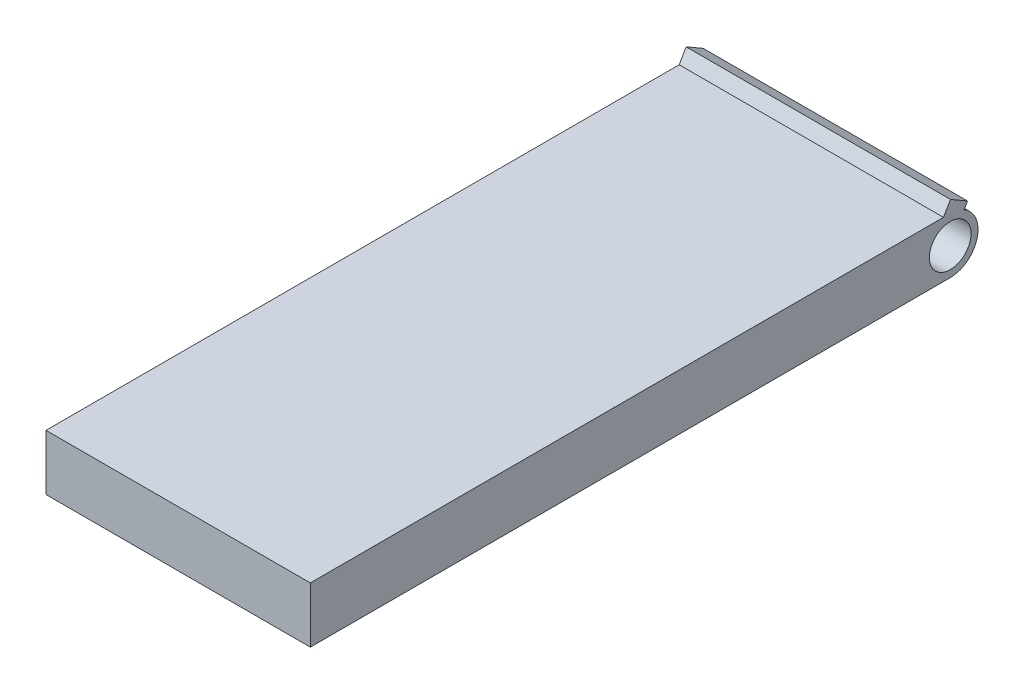
ISO-10303-21;
HEADER;
FILE_DESCRIPTION(('STEP AP214'),'2;1');
FILE_NAME('part.step','',(''),(''),'','','');
FILE_SCHEMA(('AUTOMOTIVE_DESIGN { 1 0 10303 214 1 1 1 1 }'));
ENDSEC;
DATA;
#1=APPLICATION_CONTEXT('core data for automotive mechanical design processes');
#2=APPLICATION_PROTOCOL_DEFINITION('international standard','automotive_design',2000,#1);
#3=PRODUCT_CONTEXT('',#1,'mechanical');
#4=PRODUCT('Part','Part','',(#3));
#5=PRODUCT_RELATED_PRODUCT_CATEGORY('part','',(#4));
#6=PRODUCT_DEFINITION_FORMATION('','',#4);
#7=PRODUCT_DEFINITION_CONTEXT('part definition',#1,'design');
#8=PRODUCT_DEFINITION('design','',#6,#7);
#9=PRODUCT_DEFINITION_SHAPE('','',#8);
#10=(LENGTH_UNIT() NAMED_UNIT(*) SI_UNIT(.MILLI.,.METRE.));
#11=(NAMED_UNIT(*) PLANE_ANGLE_UNIT() SI_UNIT($,.RADIAN.));
#12=(NAMED_UNIT(*) SI_UNIT($,.STERADIAN.) SOLID_ANGLE_UNIT());
#13=UNCERTAINTY_MEASURE_WITH_UNIT(LENGTH_MEASURE(1.E-05),#10,'distance_accuracy_value','');
#14=(GEOMETRIC_REPRESENTATION_CONTEXT(3) GLOBAL_UNCERTAINTY_ASSIGNED_CONTEXT((#13)) GLOBAL_UNIT_ASSIGNED_CONTEXT((#10,
#11,#12)) REPRESENTATION_CONTEXT('',''));
#15=CARTESIAN_POINT('',(0.,0.,0.));
#16=DIRECTION('',(0.,0.,1.));
#17=DIRECTION('',(1.,0.,0.));
#18=AXIS2_PLACEMENT_3D('',#15,#16,#17);
#19=CARTESIAN_POINT('',(0.,2.,0.));
#20=DIRECTION('',(0.,-1.,0.));
#21=DIRECTION('',(0.,0.,-1.));
#22=AXIS2_PLACEMENT_3D('',#19,#20,#21);
#23=PLANE('',#22);
#24=DIRECTION('',(1.,0.,0.));
#25=VECTOR('',#24,1.);
#26=CARTESIAN_POINT('',(-5.71697859541147,2.,-11.0197316533766));
#27=LINE('',#26,#25);
#28=CARTESIAN_POINT('',(-4.75,2.,-11.0197316533766));
#29=VERTEX_POINT('',#28);
#30=CARTESIAN_POINT('',(4.75,2.,-11.0197316533766));
#31=VERTEX_POINT('',#30);
#32=EDGE_CURVE('E98',#29,#31,#27,.T.);
#33=ORIENTED_EDGE('',*,*,#32,.F.);
#34=DIRECTION('',(0.,0.,1.));
#35=VECTOR('',#34,1.);
#36=CARTESIAN_POINT('',(-4.75,2.,-12.261859188115));
#37=LINE('',#36,#35);
#38=CARTESIAN_POINT('',(-4.75,2.,11.738140811885));
#39=VERTEX_POINT('',#38);
#40=EDGE_CURVE('E189',#29,#39,#37,.T.);
#41=ORIENTED_EDGE('',*,*,#40,.T.);
#42=DIRECTION('',(1.,0.,0.));
#43=VECTOR('',#42,1.);
#44=CARTESIAN_POINT('',(4.75,2.,11.738140811885));
#45=LINE('',#44,#43);
#46=CARTESIAN_POINT('',(4.75,2.,11.738140811885));
#47=VERTEX_POINT('',#46);
#48=EDGE_CURVE('E191',#39,#47,#45,.T.);
#49=ORIENTED_EDGE('',*,*,#48,.T.);
#50=DIRECTION('',(0.,0.,-1.));
#51=VECTOR('',#50,1.);
#52=CARTESIAN_POINT('',(4.75,2.,-12.261859188115));
#53=LINE('',#52,#51);
#54=EDGE_CURVE('E194',#47,#31,#53,.T.);
#55=ORIENTED_EDGE('',*,*,#54,.T.);
#56=EDGE_LOOP('',(#33,#41,#49,#55));
#57=FACE_BOUND('',#56,.T.);
#58=ADVANCED_FACE('F83',(#57),#23,.F.);
#59=CARTESIAN_POINT('',(-4.75,2.,-12.261859188115));
#60=DIRECTION('',(1.,0.,0.));
#61=DIRECTION('',(0.,0.,-1.));
#62=AXIS2_PLACEMENT_3D('',#59,#60,#61);
#63=PLANE('',#62);
#64=CARTESIAN_POINT('',(-4.75,1.,-11.261859188115));
#65=DIRECTION('',(1.,0.,0.));
#66=DIRECTION('',(0.,0.,-1.));
#67=AXIS2_PLACEMENT_3D('',#64,#65,#66);
#68=CIRCLE('',#67,0.75);
#69=CARTESIAN_POINT('',(-4.75,1.,-12.011859188115));
#70=VERTEX_POINT('',#69);
#71=EDGE_CURVE('E183',#70,#70,#68,.T.);
#72=ORIENTED_EDGE('',*,*,#71,.T.);
#73=EDGE_LOOP('',(#72));
#74=FACE_BOUND('',#73,.T.);
#75=DIRECTION('',(0.,0.866025403784436,-0.500000000000004));
#76=VECTOR('',#75,1.);
#77=CARTESIAN_POINT('',(-4.75,-4.6265280753754,-8.01338168919396));
#78=LINE('',#77,#76);
#79=CARTESIAN_POINT('',(-4.75,1.86602540378444,-11.761859188115));
#80=VERTEX_POINT('',#79);
#81=CARTESIAN_POINT('',(-4.75,2.07816840387267,-11.8843400063226));
#82=VERTEX_POINT('',#81);
#83=EDGE_CURVE('E172',#80,#82,#78,.T.);
#84=ORIENTED_EDGE('',*,*,#83,.F.);
#85=CARTESIAN_POINT('',(-4.75,1.,-11.261859188115));
#86=DIRECTION('',(1.,0.,0.));
#87=DIRECTION('',(0.,0.,-1.));
#88=AXIS2_PLACEMENT_3D('',#85,#86,#87);
#89=CIRCLE('',#88,1.);
#90=CARTESIAN_POINT('',(-4.75,0.,-11.261859188115));
#91=VERTEX_POINT('',#90);
#92=EDGE_CURVE('E177',#91,#80,#89,.T.);
#93=ORIENTED_EDGE('',*,*,#92,.F.);
#94=DIRECTION('',(0.,0.,1.));
#95=VECTOR('',#94,1.);
#96=CARTESIAN_POINT('',(-4.75,0.,-12.261859188115));
#97=LINE('',#96,#95);
#98=CARTESIAN_POINT('',(-4.75,0.,11.738140811885));
#99=VERTEX_POINT('',#98);
#100=EDGE_CURVE('E186',#91,#99,#97,.T.);
#101=ORIENTED_EDGE('',*,*,#100,.T.);
#102=DIRECTION('',(0.,-1.,0.));
#103=VECTOR('',#102,1.);
#104=CARTESIAN_POINT('',(-4.75,2.,11.738140811885));
#105=LINE('',#104,#103);
#106=EDGE_CURVE('E12',#39,#99,#105,.T.);
#107=ORIENTED_EDGE('',*,*,#106,.F.);
#108=ORIENTED_EDGE('',*,*,#40,.F.);
#109=DIRECTION('',(0.,0.866025403784437,-0.500000000000004));
#110=VECTOR('',#109,1.);
#111=CARTESIAN_POINT('',(-4.75,-4.27168377735585,-7.398773336248));
#112=LINE('',#111,#110);
#113=CARTESIAN_POINT('',(-4.75,2.43301270189222,-11.2697316533766));
#114=VERTEX_POINT('',#113);
#115=EDGE_CURVE('E170',#29,#114,#112,.T.);
#116=ORIENTED_EDGE('',*,*,#115,.T.);
#117=DIRECTION('',(0.,-0.500000000000004,-0.866025403784437));
#118=VECTOR('',#117,1.);
#119=CARTESIAN_POINT('',(-4.75,6.70469647924807,-3.87095831712865));
#120=LINE('',#119,#118);
#121=EDGE_CURVE('E150',#114,#82,#120,.T.);
#122=ORIENTED_EDGE('',*,*,#121,.T.);
#123=EDGE_LOOP('',(#84,#93,#101,#107,#108,#116,#122));
#124=FACE_BOUND('',#123,.T.);
#125=ADVANCED_FACE('F85',(#74,#124),#63,.F.);
#126=CARTESIAN_POINT('',(4.75,2.,-12.261859188115));
#127=DIRECTION('',(-1.,0.,0.));
#128=DIRECTION('',(0.,0.,1.));
#129=AXIS2_PLACEMENT_3D('',#126,#127,#128);
#130=PLANE('',#129);
#131=CARTESIAN_POINT('',(4.75,1.,-11.261859188115));
#132=DIRECTION('',(1.,0.,0.));
#133=DIRECTION('',(0.,0.,-1.));
#134=AXIS2_PLACEMENT_3D('',#131,#132,#133);
#135=CIRCLE('',#134,0.75);
#136=CARTESIAN_POINT('',(4.75,1.,-12.011859188115));
#137=VERTEX_POINT('',#136);
#138=EDGE_CURVE('E182',#137,#137,#135,.T.);
#139=ORIENTED_EDGE('',*,*,#138,.F.);
#140=EDGE_LOOP('',(#139));
#141=FACE_BOUND('',#140,.T.);
#142=CARTESIAN_POINT('',(4.75,1.,-11.261859188115));
#143=DIRECTION('',(1.,0.,0.));
#144=DIRECTION('',(0.,0.,-1.));
#145=AXIS2_PLACEMENT_3D('',#142,#143,#144);
#146=CIRCLE('',#145,1.);
#147=CARTESIAN_POINT('',(4.75,0.,-11.261859188115));
#148=VERTEX_POINT('',#147);
#149=CARTESIAN_POINT('',(4.75,1.86602540378444,-11.761859188115));
#150=VERTEX_POINT('',#149);
#151=EDGE_CURVE('E106',#148,#150,#146,.T.);
#152=ORIENTED_EDGE('',*,*,#151,.T.);
#153=DIRECTION('',(0.,0.866025403784436,-0.500000000000004));
#154=VECTOR('',#153,1.);
#155=CARTESIAN_POINT('',(4.75,-4.6265280753754,-8.01338168919396));
#156=LINE('',#155,#154);
#157=CARTESIAN_POINT('',(4.75,2.07816840387267,-11.8843400063226));
#158=VERTEX_POINT('',#157);
#159=EDGE_CURVE('E162',#150,#158,#156,.T.);
#160=ORIENTED_EDGE('',*,*,#159,.T.);
#161=DIRECTION('',(0.,0.500000000000004,0.866025403784437));
#162=VECTOR('',#161,1.);
#163=CARTESIAN_POINT('',(4.75,6.70469647924807,-3.87095831712865));
#164=LINE('',#163,#162);
#165=CARTESIAN_POINT('',(4.75,2.43301270189222,-11.2697316533766));
#166=VERTEX_POINT('',#165);
#167=EDGE_CURVE('E148',#158,#166,#164,.T.);
#168=ORIENTED_EDGE('',*,*,#167,.T.);
#169=DIRECTION('',(0.,-0.866025403784437,0.500000000000004));
#170=VECTOR('',#169,1.);
#171=CARTESIAN_POINT('',(4.75,-4.27168377735585,-7.398773336248));
#172=LINE('',#171,#170);
#173=EDGE_CURVE('E153',#166,#31,#172,.T.);
#174=ORIENTED_EDGE('',*,*,#173,.T.);
#175=ORIENTED_EDGE('',*,*,#54,.F.);
#176=DIRECTION('',(0.,-1.,0.));
#177=VECTOR('',#176,1.);
#178=CARTESIAN_POINT('',(4.75,2.,11.738140811885));
#179=LINE('',#178,#177);
#180=CARTESIAN_POINT('',(4.75,0.,11.738140811885));
#181=VERTEX_POINT('',#180);
#182=EDGE_CURVE('E91',#47,#181,#179,.T.);
#183=ORIENTED_EDGE('',*,*,#182,.T.);
#184=DIRECTION('',(0.,0.,-1.));
#185=VECTOR('',#184,1.);
#186=CARTESIAN_POINT('',(4.75,0.,-12.261859188115));
#187=LINE('',#186,#185);
#188=EDGE_CURVE('E192',#181,#148,#187,.T.);
#189=ORIENTED_EDGE('',*,*,#188,.T.);
#190=EDGE_LOOP('',(#152,#160,#168,#174,#175,#183,#189));
#191=FACE_BOUND('',#190,.T.);
#192=ADVANCED_FACE('F160',(#141,#191),#130,.F.);
#193=CARTESIAN_POINT('',(0.,0.,0.));
#194=DIRECTION('',(0.,-1.,0.));
#195=DIRECTION('',(0.,0.,-1.));
#196=AXIS2_PLACEMENT_3D('',#193,#194,#195);
#197=PLANE('',#196);
#198=ORIENTED_EDGE('',*,*,#100,.F.);
#199=DIRECTION('',(1.,0.,0.));
#200=VECTOR('',#199,1.);
#201=CARTESIAN_POINT('',(-4.75,0.,-11.261859188115));
#202=LINE('',#201,#200);
#203=EDGE_CURVE('E179',#91,#148,#202,.T.);
#204=ORIENTED_EDGE('',*,*,#203,.T.);
#205=ORIENTED_EDGE('',*,*,#188,.F.);
#206=DIRECTION('',(1.,0.,0.));
#207=VECTOR('',#206,1.);
#208=CARTESIAN_POINT('',(4.75,0.,11.738140811885));
#209=LINE('',#208,#207);
#210=EDGE_CURVE('E197',#99,#181,#209,.T.);
#211=ORIENTED_EDGE('',*,*,#210,.F.);
#212=EDGE_LOOP('',(#198,#204,#205,#211));
#213=FACE_BOUND('',#212,.T.);
#214=ADVANCED_FACE('F208',(#213),#197,.T.);
#215=CARTESIAN_POINT('',(4.75,2.,11.738140811885));
#216=DIRECTION('',(0.,0.,-1.));
#217=DIRECTION('',(-1.,0.,0.));
#218=AXIS2_PLACEMENT_3D('',#215,#216,#217);
#219=PLANE('',#218);
#220=ORIENTED_EDGE('',*,*,#210,.T.);
#221=ORIENTED_EDGE('',*,*,#182,.F.);
#222=ORIENTED_EDGE('',*,*,#48,.F.);
#223=ORIENTED_EDGE('',*,*,#106,.T.);
#224=EDGE_LOOP('',(#220,#221,#222,#223));
#225=FACE_BOUND('',#224,.T.);
#226=ADVANCED_FACE('F236',(#225),#219,.F.);
#227=CARTESIAN_POINT('',(-4.75,1.,-11.261859188115));
#228=DIRECTION('',(1.,0.,0.));
#229=DIRECTION('',(0.,0.,-1.));
#230=AXIS2_PLACEMENT_3D('',#227,#228,#229);
#231=CYLINDRICAL_SURFACE('',#230,0.75);
#232=ORIENTED_EDGE('',*,*,#71,.F.);
#233=EDGE_LOOP('',(#232));
#234=FACE_BOUND('',#233,.T.);
#235=ORIENTED_EDGE('',*,*,#138,.T.);
#236=EDGE_LOOP('',(#235));
#237=FACE_BOUND('',#236,.T.);
#238=ADVANCED_FACE('F224',(#234,#237),#231,.F.);
#239=CARTESIAN_POINT('',(-4.75,1.,-11.261859188115));
#240=DIRECTION('',(1.,0.,0.));
#241=DIRECTION('',(0.,0.,-1.));
#242=AXIS2_PLACEMENT_3D('',#239,#240,#241);
#243=CYLINDRICAL_SURFACE('',#242,1.);
#244=ORIENTED_EDGE('',*,*,#151,.F.);
#245=ORIENTED_EDGE('',*,*,#203,.F.);
#246=ORIENTED_EDGE('',*,*,#92,.T.);
#247=DIRECTION('',(1.,0.,0.));
#248=VECTOR('',#247,1.);
#249=CARTESIAN_POINT('',(-4.75,1.86602540378444,-11.761859188115));
#250=LINE('',#249,#248);
#251=EDGE_CURVE('E174',#80,#150,#250,.T.);
#252=ORIENTED_EDGE('',*,*,#251,.T.);
#253=EDGE_LOOP('',(#244,#245,#246,#252));
#254=FACE_BOUND('',#253,.T.);
#255=ADVANCED_FACE('F210',(#254),#243,.T.);
#256=CARTESIAN_POINT('',(-4.75,-4.6265280753754,-8.01338168919396));
#257=DIRECTION('',(0.,-0.500000000000004,-0.866025403784436));
#258=DIRECTION('',(0.,0.866025403784436,-0.500000000000004));
#259=AXIS2_PLACEMENT_3D('',#256,#257,#258);
#260=PLANE('',#259);
#261=ORIENTED_EDGE('',*,*,#159,.F.);
#262=ORIENTED_EDGE('',*,*,#251,.F.);
#263=ORIENTED_EDGE('',*,*,#83,.T.);
#264=DIRECTION('',(1.,0.,0.));
#265=VECTOR('',#264,1.);
#266=CARTESIAN_POINT('',(-5.71697859541147,2.07816840387267,-11.8843400063226));
#267=LINE('',#266,#265);
#268=EDGE_CURVE('E167',#82,#158,#267,.T.);
#269=ORIENTED_EDGE('',*,*,#268,.T.);
#270=EDGE_LOOP('',(#261,#262,#263,#269));
#271=FACE_BOUND('',#270,.T.);
#272=ADVANCED_FACE('F216',(#271),#260,.T.);
#273=CARTESIAN_POINT('',(-5.71697859541147,6.70469647924807,-3.87095831712865));
#274=DIRECTION('',(0.,0.866025403784437,-0.500000000000004));
#275=DIRECTION('',(0.,0.500000000000004,0.866025403784437));
#276=AXIS2_PLACEMENT_3D('',#273,#274,#275);
#277=PLANE('',#276);
#278=ORIENTED_EDGE('',*,*,#121,.F.);
#279=DIRECTION('',(1.,0.,0.));
#280=VECTOR('',#279,1.);
#281=CARTESIAN_POINT('',(-5.71697859541147,2.43301270189222,-11.2697316533766));
#282=LINE('',#281,#280);
#283=EDGE_CURVE('E143',#114,#166,#282,.T.);
#284=ORIENTED_EDGE('',*,*,#283,.T.);
#285=ORIENTED_EDGE('',*,*,#167,.F.);
#286=ORIENTED_EDGE('',*,*,#268,.F.);
#287=EDGE_LOOP('',(#278,#284,#285,#286));
#288=FACE_BOUND('',#287,.T.);
#289=ADVANCED_FACE('F145',(#288),#277,.T.);
#290=CARTESIAN_POINT('',(-5.71697859541147,-4.27168377735585,-7.398773336248));
#291=DIRECTION('',(0.,0.500000000000004,0.866025403784437));
#292=DIRECTION('',(0.,-0.866025403784437,0.500000000000004));
#293=AXIS2_PLACEMENT_3D('',#290,#291,#292);
#294=PLANE('',#293);
#295=ORIENTED_EDGE('',*,*,#115,.F.);
#296=ORIENTED_EDGE('',*,*,#32,.T.);
#297=ORIENTED_EDGE('',*,*,#173,.F.);
#298=ORIENTED_EDGE('',*,*,#283,.F.);
#299=EDGE_LOOP('',(#295,#296,#297,#298));
#300=FACE_BOUND('',#299,.T.);
#301=ADVANCED_FACE('F156',(#300),#294,.T.);
#302=CLOSED_SHELL('',(#58,#125,#192,#214,#226,#238,#255,#272,#289,#301));
#303=MANIFOLD_SOLID_BREP('B2',#302);
#304=ADVANCED_BREP_SHAPE_REPRESENTATION('',(#18,#303),#14);
#305=SHAPE_DEFINITION_REPRESENTATION(#9,#304);
ENDSEC;
END-ISO-10303-21;
